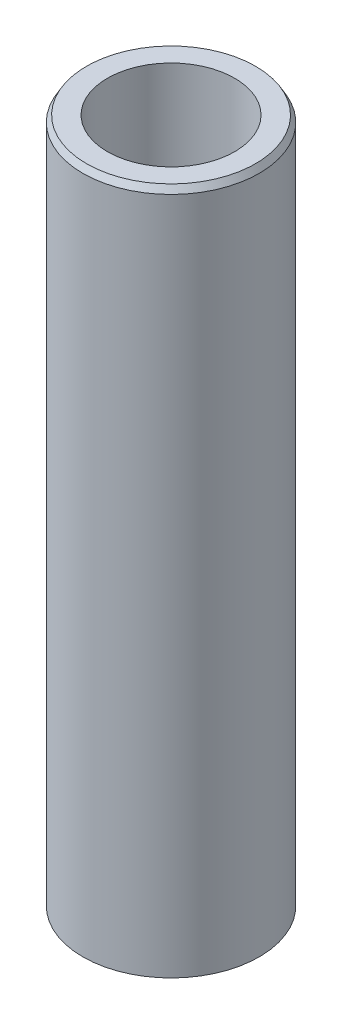
ISO-10303-21;
HEADER;
FILE_DESCRIPTION(('STEP AP214'),'2;1');
FILE_NAME('part.step','',(''),(''),'','','');
FILE_SCHEMA(('AUTOMOTIVE_DESIGN { 1 0 10303 214 1 1 1 1 }'));
ENDSEC;
DATA;
#1=APPLICATION_CONTEXT('core data for automotive mechanical design processes');
#2=APPLICATION_PROTOCOL_DEFINITION('international standard','automotive_design',2000,#1);
#3=PRODUCT_CONTEXT('',#1,'mechanical');
#4=PRODUCT('Part','Part','',(#3));
#5=PRODUCT_RELATED_PRODUCT_CATEGORY('part','',(#4));
#6=PRODUCT_DEFINITION_FORMATION('','',#4);
#7=PRODUCT_DEFINITION_CONTEXT('part definition',#1,'design');
#8=PRODUCT_DEFINITION('design','',#6,#7);
#9=PRODUCT_DEFINITION_SHAPE('','',#8);
#10=(LENGTH_UNIT() NAMED_UNIT(*) SI_UNIT(.MILLI.,.METRE.));
#11=(NAMED_UNIT(*) PLANE_ANGLE_UNIT() SI_UNIT($,.RADIAN.));
#12=(NAMED_UNIT(*) SI_UNIT($,.STERADIAN.) SOLID_ANGLE_UNIT());
#13=UNCERTAINTY_MEASURE_WITH_UNIT(LENGTH_MEASURE(1.E-05),#10,'distance_accuracy_value','');
#14=(GEOMETRIC_REPRESENTATION_CONTEXT(3) GLOBAL_UNCERTAINTY_ASSIGNED_CONTEXT((#13)) GLOBAL_UNIT_ASSIGNED_CONTEXT((#10,
#11,#12)) REPRESENTATION_CONTEXT('',''));
#15=CARTESIAN_POINT('',(0.,0.,0.));
#16=DIRECTION('',(0.,0.,1.));
#17=DIRECTION('',(1.,0.,0.));
#18=AXIS2_PLACEMENT_3D('',#15,#16,#17);
#19=CARTESIAN_POINT('',(0.,292.768463465574,0.));
#20=DIRECTION('',(0.,-1.,0.));
#21=DIRECTION('',(0.,0.,-1.));
#22=AXIS2_PLACEMENT_3D('',#19,#20,#21);
#23=CYLINDRICAL_SURFACE('',#22,37.5);
#24=CARTESIAN_POINT('',(0.,290.015390416902,0.));
#25=DIRECTION('',(0.,1.,0.));
#26=DIRECTION('',(0.,0.,1.));
#27=AXIS2_PLACEMENT_3D('',#24,#25,#26);
#28=CIRCLE('',#27,37.5);
#29=CARTESIAN_POINT('',(0.,290.015390416902,37.5));
#30=VERTEX_POINT('',#29);
#31=EDGE_CURVE('E50',#30,#30,#28,.F.);
#32=ORIENTED_EDGE('',*,*,#31,.T.);
#33=EDGE_LOOP('',(#32));
#34=FACE_BOUND('',#33,.T.);
#35=CARTESIAN_POINT('',(0.,1.58948746574944,0.));
#36=DIRECTION('',(0.,1.,0.));
#37=DIRECTION('',(0.,0.,1.));
#38=AXIS2_PLACEMENT_3D('',#35,#36,#37);
#39=CIRCLE('',#38,37.5);
#40=CARTESIAN_POINT('',(0.,1.58948746574944,37.5));
#41=VERTEX_POINT('',#40);
#42=EDGE_CURVE('E51',#41,#41,#39,.T.);
#43=ORIENTED_EDGE('',*,*,#42,.T.);
#44=EDGE_LOOP('',(#43));
#45=FACE_BOUND('',#44,.T.);
#46=ADVANCED_FACE('F39',(#34,#45),#23,.T.);
#47=CARTESIAN_POINT('',(0.,292.768463465574,0.));
#48=DIRECTION('',(0.,1.,0.));
#49=DIRECTION('',(0.,0.,1.));
#50=AXIS2_PLACEMENT_3D('',#47,#48,#49);
#51=PLANE('',#50);
#52=CARTESIAN_POINT('',(0.,292.768463465574,0.));
#53=DIRECTION('',(0.,1.,0.));
#54=DIRECTION('',(0.,0.,1.));
#55=AXIS2_PLACEMENT_3D('',#52,#53,#54);
#56=CIRCLE('',#55,35.9105125342504);
#57=CARTESIAN_POINT('',(0.,292.768463465574,35.9105125342504));
#58=VERTEX_POINT('',#57);
#59=EDGE_CURVE('E54',#58,#58,#56,.T.);
#60=ORIENTED_EDGE('',*,*,#59,.T.);
#61=EDGE_LOOP('',(#60));
#62=FACE_BOUND('',#61,.T.);
#63=CARTESIAN_POINT('',(0.,292.768463465574,0.));
#64=DIRECTION('',(0.,1.,0.));
#65=DIRECTION('',(0.,0.,1.));
#66=AXIS2_PLACEMENT_3D('',#63,#64,#65);
#67=CIRCLE('',#66,27.0588339087476);
#68=CARTESIAN_POINT('',(0.,292.768463465574,27.0588339087476));
#69=VERTEX_POINT('',#68);
#70=EDGE_CURVE('E58',#69,#69,#67,.T.);
#71=ORIENTED_EDGE('',*,*,#70,.F.);
#72=EDGE_LOOP('',(#71));
#73=FACE_BOUND('',#72,.T.);
#74=ADVANCED_FACE('F69',(#62,#73),#51,.T.);
#75=CARTESIAN_POINT('',(0.,0.,0.));
#76=DIRECTION('',(0.,1.,0.));
#77=DIRECTION('',(0.,0.,1.));
#78=AXIS2_PLACEMENT_3D('',#75,#76,#77);
#79=PLANE('',#78);
#80=CARTESIAN_POINT('',(0.,0.,0.));
#81=DIRECTION('',(0.,1.,0.));
#82=DIRECTION('',(0.,0.,1.));
#83=AXIS2_PLACEMENT_3D('',#80,#81,#82);
#84=CIRCLE('',#83,34.746926951328);
#85=CARTESIAN_POINT('',(0.,0.,34.746926951328));
#86=VERTEX_POINT('',#85);
#87=EDGE_CURVE('E10',#86,#86,#84,.F.);
#88=ORIENTED_EDGE('',*,*,#87,.T.);
#89=EDGE_LOOP('',(#88));
#90=FACE_BOUND('',#89,.T.);
#91=CARTESIAN_POINT('',(0.,0.,0.));
#92=DIRECTION('',(0.,1.,0.));
#93=DIRECTION('',(0.,0.,1.));
#94=AXIS2_PLACEMENT_3D('',#91,#92,#93);
#95=CIRCLE('',#94,27.0588339087476);
#96=CARTESIAN_POINT('',(0.,0.,27.0588339087476));
#97=VERTEX_POINT('',#96);
#98=EDGE_CURVE('E63',#97,#97,#95,.T.);
#99=ORIENTED_EDGE('',*,*,#98,.T.);
#100=EDGE_LOOP('',(#99));
#101=FACE_BOUND('',#100,.T.);
#102=ADVANCED_FACE('F75',(#90,#101),#79,.F.);
#103=CARTESIAN_POINT('',(0.,292.768463465574,0.));
#104=DIRECTION('',(0.,-1.,0.));
#105=DIRECTION('',(0.,0.,-1.));
#106=AXIS2_PLACEMENT_3D('',#103,#104,#105);
#107=CYLINDRICAL_SURFACE('',#106,27.0588339087476);
#108=ORIENTED_EDGE('',*,*,#70,.T.);
#109=EDGE_LOOP('',(#108));
#110=FACE_BOUND('',#109,.T.);
#111=ORIENTED_EDGE('',*,*,#98,.F.);
#112=EDGE_LOOP('',(#111));
#113=FACE_BOUND('',#112,.T.);
#114=ADVANCED_FACE('F70',(#110,#113),#107,.F.);
#115=CARTESIAN_POINT('',(0.,292.768463465574,0.));
#116=DIRECTION('',(0.,-1.,0.));
#117=DIRECTION('',(0.,0.,-1.));
#118=AXIS2_PLACEMENT_3D('',#115,#116,#117);
#119=CONICAL_SURFACE('',#118,35.9105125342504,0.523598775598298);
#120=ORIENTED_EDGE('',*,*,#31,.F.);
#121=EDGE_LOOP('',(#120));
#122=FACE_BOUND('',#121,.T.);
#123=ORIENTED_EDGE('',*,*,#59,.F.);
#124=EDGE_LOOP('',(#123));
#125=FACE_BOUND('',#124,.T.);
#126=ADVANCED_FACE('F81',(#122,#125),#119,.T.);
#127=CARTESIAN_POINT('',(0.,1.58948746574944,0.));
#128=DIRECTION('',(0.,1.,0.));
#129=DIRECTION('',(0.,0.,1.));
#130=AXIS2_PLACEMENT_3D('',#127,#128,#129);
#131=CONICAL_SURFACE('',#130,37.5,1.04719755119661);
#132=ORIENTED_EDGE('',*,*,#87,.F.);
#133=EDGE_LOOP('',(#132));
#134=FACE_BOUND('',#133,.T.);
#135=ORIENTED_EDGE('',*,*,#42,.F.);
#136=EDGE_LOOP('',(#135));
#137=FACE_BOUND('',#136,.T.);
#138=ADVANCED_FACE('F45',(#134,#137),#131,.T.);
#139=CLOSED_SHELL('',(#46,#74,#102,#114,#126,#138));
#140=MANIFOLD_SOLID_BREP('B2',#139);
#141=ADVANCED_BREP_SHAPE_REPRESENTATION('',(#18,#140),#14);
#142=SHAPE_DEFINITION_REPRESENTATION(#9,#141);
ENDSEC;
END-ISO-10303-21;
